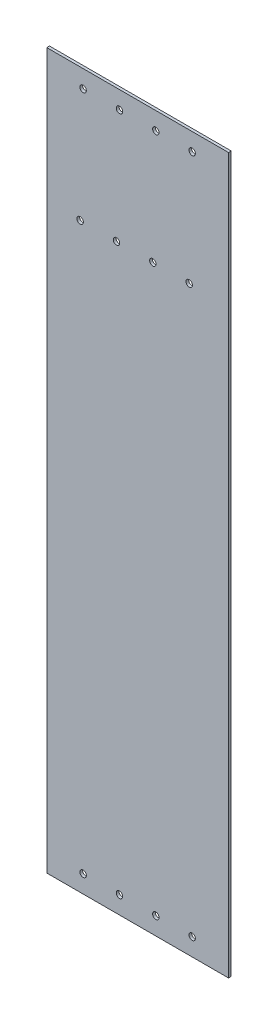
ISO-10303-21;
HEADER;
FILE_DESCRIPTION(('STEP AP214'),'2;1');
FILE_NAME('part.step','',(''),(''),'','','');
FILE_SCHEMA(('AUTOMOTIVE_DESIGN { 1 0 10303 214 1 1 1 1 }'));
ENDSEC;
DATA;
#1=APPLICATION_CONTEXT('core data for automotive mechanical design processes');
#2=APPLICATION_PROTOCOL_DEFINITION('international standard','automotive_design',2000,#1);
#3=PRODUCT_CONTEXT('',#1,'mechanical');
#4=PRODUCT('Part','Part','',(#3));
#5=PRODUCT_RELATED_PRODUCT_CATEGORY('part','',(#4));
#6=PRODUCT_DEFINITION_FORMATION('','',#4);
#7=PRODUCT_DEFINITION_CONTEXT('part definition',#1,'design');
#8=PRODUCT_DEFINITION('design','',#6,#7);
#9=PRODUCT_DEFINITION_SHAPE('','',#8);
#10=(LENGTH_UNIT() NAMED_UNIT(*) SI_UNIT(.MILLI.,.METRE.));
#11=(NAMED_UNIT(*) PLANE_ANGLE_UNIT() SI_UNIT($,.RADIAN.));
#12=(NAMED_UNIT(*) SI_UNIT($,.STERADIAN.) SOLID_ANGLE_UNIT());
#13=UNCERTAINTY_MEASURE_WITH_UNIT(LENGTH_MEASURE(1.E-05),#10,'distance_accuracy_value','');
#14=(GEOMETRIC_REPRESENTATION_CONTEXT(3) GLOBAL_UNCERTAINTY_ASSIGNED_CONTEXT((#13)) GLOBAL_UNIT_ASSIGNED_CONTEXT((#10,
#11,#12)) REPRESENTATION_CONTEXT('',''));
#15=CARTESIAN_POINT('',(0.,0.,0.));
#16=DIRECTION('',(0.,0.,1.));
#17=DIRECTION('',(1.,0.,0.));
#18=AXIS2_PLACEMENT_3D('',#15,#16,#17);
#19=CARTESIAN_POINT('',(43.96,191.395,0.));
#20=DIRECTION('',(0.,0.,1.));
#21=DIRECTION('',(1.,0.,0.));
#22=AXIS2_PLACEMENT_3D('',#19,#20,#21);
#23=CYLINDRICAL_SURFACE('',#22,2.75);
#24=CARTESIAN_POINT('',(43.96,191.395,0.));
#25=DIRECTION('',(0.,0.,1.));
#26=DIRECTION('',(1.,0.,0.));
#27=AXIS2_PLACEMENT_3D('',#24,#25,#26);
#28=CIRCLE('',#27,2.75);
#29=CARTESIAN_POINT('',(46.71,191.395,0.));
#30=VERTEX_POINT('',#29);
#31=EDGE_CURVE('E48',#30,#30,#28,.T.);
#32=ORIENTED_EDGE('',*,*,#31,.F.);
#33=EDGE_LOOP('',(#32));
#34=FACE_BOUND('',#33,.T.);
#35=CARTESIAN_POINT('',(43.96,191.395,2.305));
#36=DIRECTION('',(0.,0.,1.));
#37=DIRECTION('',(1.,0.,0.));
#38=AXIS2_PLACEMENT_3D('',#35,#36,#37);
#39=CIRCLE('',#38,2.75);
#40=CARTESIAN_POINT('',(46.71,191.395,2.305));
#41=VERTEX_POINT('',#40);
#42=EDGE_CURVE('E11',#41,#41,#39,.T.);
#43=ORIENTED_EDGE('',*,*,#42,.T.);
#44=EDGE_LOOP('',(#43));
#45=FACE_BOUND('',#44,.T.);
#46=ADVANCED_FACE('F39',(#34,#45),#23,.F.);
#47=CARTESIAN_POINT('',(12.96,191.395,0.));
#48=DIRECTION('',(0.,0.,1.));
#49=DIRECTION('',(1.,0.,0.));
#50=AXIS2_PLACEMENT_3D('',#47,#48,#49);
#51=CYLINDRICAL_SURFACE('',#50,2.75);
#52=CARTESIAN_POINT('',(12.96,191.395,0.));
#53=DIRECTION('',(0.,0.,1.));
#54=DIRECTION('',(1.,0.,0.));
#55=AXIS2_PLACEMENT_3D('',#52,#53,#54);
#56=CIRCLE('',#55,2.75);
#57=CARTESIAN_POINT('',(15.71,191.395,0.));
#58=VERTEX_POINT('',#57);
#59=EDGE_CURVE('E129',#58,#58,#56,.T.);
#60=ORIENTED_EDGE('',*,*,#59,.F.);
#61=EDGE_LOOP('',(#60));
#62=FACE_BOUND('',#61,.T.);
#63=CARTESIAN_POINT('',(12.96,191.395,2.305));
#64=DIRECTION('',(0.,0.,1.));
#65=DIRECTION('',(1.,0.,0.));
#66=AXIS2_PLACEMENT_3D('',#63,#64,#65);
#67=CIRCLE('',#66,2.75);
#68=CARTESIAN_POINT('',(15.71,191.395,2.305));
#69=VERTEX_POINT('',#68);
#70=EDGE_CURVE('E133',#69,#69,#67,.T.);
#71=ORIENTED_EDGE('',*,*,#70,.T.);
#72=EDGE_LOOP('',(#71));
#73=FACE_BOUND('',#72,.T.);
#74=ADVANCED_FACE('F144',(#62,#73),#51,.F.);
#75=CARTESIAN_POINT('',(77.5,304.8,2.305));
#76=DIRECTION('',(-1.,0.,0.));
#77=DIRECTION('',(0.,-1.,0.));
#78=AXIS2_PLACEMENT_3D('',#75,#76,#77);
#79=PLANE('',#78);
#80=DIRECTION('',(0.,1.,0.));
#81=VECTOR('',#80,1.);
#82=CARTESIAN_POINT('',(77.5,304.8,0.));
#83=LINE('',#82,#81);
#84=CARTESIAN_POINT('',(77.5000000000001,-304.8,0.));
#85=VERTEX_POINT('',#84);
#86=CARTESIAN_POINT('',(77.5,304.8,0.));
#87=VERTEX_POINT('',#86);
#88=EDGE_CURVE('E112',#85,#87,#83,.T.);
#89=ORIENTED_EDGE('',*,*,#88,.T.);
#90=DIRECTION('',(0.,0.,-1.));
#91=VECTOR('',#90,1.);
#92=CARTESIAN_POINT('',(77.5,304.8,2.305));
#93=LINE('',#92,#91);
#94=CARTESIAN_POINT('',(77.5,304.8,2.305));
#95=VERTEX_POINT('',#94);
#96=EDGE_CURVE('E101',#95,#87,#93,.T.);
#97=ORIENTED_EDGE('',*,*,#96,.F.);
#98=DIRECTION('',(0.,1.,0.));
#99=VECTOR('',#98,1.);
#100=CARTESIAN_POINT('',(77.5,304.8,2.305));
#101=LINE('',#100,#99);
#102=CARTESIAN_POINT('',(77.5000000000001,-304.8,2.305));
#103=VERTEX_POINT('',#102);
#104=EDGE_CURVE('E93',#103,#95,#101,.T.);
#105=ORIENTED_EDGE('',*,*,#104,.F.);
#106=DIRECTION('',(0.,0.,-1.));
#107=VECTOR('',#106,1.);
#108=CARTESIAN_POINT('',(77.5000000000001,-304.8,2.305));
#109=LINE('',#108,#107);
#110=EDGE_CURVE('E108',#103,#85,#109,.T.);
#111=ORIENTED_EDGE('',*,*,#110,.T.);
#112=EDGE_LOOP('',(#89,#97,#105,#111));
#113=FACE_BOUND('',#112,.T.);
#114=ADVANCED_FACE('F168',(#113),#79,.F.);
#115=CARTESIAN_POINT('',(-77.5,304.8,2.305));
#116=DIRECTION('',(0.,-1.,0.));
#117=DIRECTION('',(0.,0.,-1.));
#118=AXIS2_PLACEMENT_3D('',#115,#116,#117);
#119=PLANE('',#118);
#120=DIRECTION('',(-1.,0.,0.));
#121=VECTOR('',#120,1.);
#122=CARTESIAN_POINT('',(-77.5,304.8,0.));
#123=LINE('',#122,#121);
#124=CARTESIAN_POINT('',(-77.5,304.8,0.));
#125=VERTEX_POINT('',#124);
#126=EDGE_CURVE('E99',#87,#125,#123,.T.);
#127=ORIENTED_EDGE('',*,*,#126,.T.);
#128=DIRECTION('',(0.,0.,-1.));
#129=VECTOR('',#128,1.);
#130=CARTESIAN_POINT('',(-77.5,304.8,2.305));
#131=LINE('',#130,#129);
#132=CARTESIAN_POINT('',(-77.5,304.8,2.305));
#133=VERTEX_POINT('',#132);
#134=EDGE_CURVE('E97',#133,#125,#131,.T.);
#135=ORIENTED_EDGE('',*,*,#134,.F.);
#136=DIRECTION('',(-1.,0.,0.));
#137=VECTOR('',#136,1.);
#138=CARTESIAN_POINT('',(-77.5,304.8,2.305));
#139=LINE('',#138,#137);
#140=EDGE_CURVE('E87',#95,#133,#139,.T.);
#141=ORIENTED_EDGE('',*,*,#140,.F.);
#142=ORIENTED_EDGE('',*,*,#96,.T.);
#143=EDGE_LOOP('',(#127,#135,#141,#142));
#144=FACE_BOUND('',#143,.T.);
#145=ADVANCED_FACE('F98',(#144),#119,.F.);
#146=CARTESIAN_POINT('',(-77.5,304.8,2.305));
#147=DIRECTION('',(1.,0.,0.));
#148=DIRECTION('',(0.,1.,0.));
#149=AXIS2_PLACEMENT_3D('',#146,#147,#148);
#150=PLANE('',#149);
#151=DIRECTION('',(0.,-1.,0.));
#152=VECTOR('',#151,1.);
#153=CARTESIAN_POINT('',(-77.5,304.8,0.));
#154=LINE('',#153,#152);
#155=CARTESIAN_POINT('',(-77.4999999999999,-304.8,0.));
#156=VERTEX_POINT('',#155);
#157=EDGE_CURVE('E73',#125,#156,#154,.T.);
#158=ORIENTED_EDGE('',*,*,#157,.T.);
#159=DIRECTION('',(0.,0.,-1.));
#160=VECTOR('',#159,1.);
#161=CARTESIAN_POINT('',(-77.4999999999999,-304.8,2.305));
#162=LINE('',#161,#160);
#163=CARTESIAN_POINT('',(-77.4999999999999,-304.8,2.305));
#164=VERTEX_POINT('',#163);
#165=EDGE_CURVE('E102',#164,#156,#162,.T.);
#166=ORIENTED_EDGE('',*,*,#165,.F.);
#167=DIRECTION('',(0.,-1.,0.));
#168=VECTOR('',#167,1.);
#169=CARTESIAN_POINT('',(-77.5,304.8,2.305));
#170=LINE('',#169,#168);
#171=EDGE_CURVE('E91',#133,#164,#170,.T.);
#172=ORIENTED_EDGE('',*,*,#171,.F.);
#173=ORIENTED_EDGE('',*,*,#134,.T.);
#174=EDGE_LOOP('',(#158,#166,#172,#173));
#175=FACE_BOUND('',#174,.T.);
#176=ADVANCED_FACE('F104',(#175),#150,.F.);
#177=CARTESIAN_POINT('',(-77.4999999999999,-304.8,2.305));
#178=DIRECTION('',(0.,1.,0.));
#179=DIRECTION('',(0.,0.,1.));
#180=AXIS2_PLACEMENT_3D('',#177,#178,#179);
#181=PLANE('',#180);
#182=DIRECTION('',(1.,0.,0.));
#183=VECTOR('',#182,1.);
#184=CARTESIAN_POINT('',(-77.4999999999999,-304.8,0.));
#185=LINE('',#184,#183);
#186=EDGE_CURVE('E79',#156,#85,#185,.T.);
#187=ORIENTED_EDGE('',*,*,#186,.T.);
#188=ORIENTED_EDGE('',*,*,#110,.F.);
#189=DIRECTION('',(1.,0.,0.));
#190=VECTOR('',#189,1.);
#191=CARTESIAN_POINT('',(-77.4999999999999,-304.8,2.305));
#192=LINE('',#191,#190);
#193=EDGE_CURVE('E56',#164,#103,#192,.T.);
#194=ORIENTED_EDGE('',*,*,#193,.F.);
#195=ORIENTED_EDGE('',*,*,#165,.T.);
#196=EDGE_LOOP('',(#187,#188,#194,#195));
#197=FACE_BOUND('',#196,.T.);
#198=ADVANCED_FACE('F148',(#197),#181,.F.);
#199=CARTESIAN_POINT('',(0.,0.,2.305));
#200=DIRECTION('',(0.,0.,1.));
#201=DIRECTION('',(1.,0.,0.));
#202=AXIS2_PLACEMENT_3D('',#199,#200,#201);
#203=PLANE('',#202);
#204=CARTESIAN_POINT('',(-18.04,191.395,2.305));
#205=DIRECTION('',(0.,0.,1.));
#206=DIRECTION('',(1.,0.,0.));
#207=AXIS2_PLACEMENT_3D('',#204,#205,#206);
#208=CIRCLE('',#207,2.75);
#209=CARTESIAN_POINT('',(-15.29,191.395,2.305));
#210=VERTEX_POINT('',#209);
#211=EDGE_CURVE('E319',#210,#210,#208,.T.);
#212=ORIENTED_EDGE('',*,*,#211,.F.);
#213=EDGE_LOOP('',(#212));
#214=FACE_BOUND('',#213,.T.);
#215=CARTESIAN_POINT('',(-49.04,191.395,2.305));
#216=DIRECTION('',(0.,0.,1.));
#217=DIRECTION('',(1.,0.,0.));
#218=AXIS2_PLACEMENT_3D('',#215,#216,#217);
#219=CIRCLE('',#218,2.75);
#220=CARTESIAN_POINT('',(-46.29,191.395,2.305));
#221=VERTEX_POINT('',#220);
#222=EDGE_CURVE('E321',#221,#221,#219,.T.);
#223=ORIENTED_EDGE('',*,*,#222,.F.);
#224=EDGE_LOOP('',(#223));
#225=FACE_BOUND('',#224,.T.);
#226=CARTESIAN_POINT('',(-46.5,289.795,2.305));
#227=DIRECTION('',(0.,0.,1.));
#228=DIRECTION('',(1.,0.,0.));
#229=AXIS2_PLACEMENT_3D('',#226,#227,#228);
#230=CIRCLE('',#229,2.74999999999999);
#231=CARTESIAN_POINT('',(-43.75,289.795,2.305));
#232=VERTEX_POINT('',#231);
#233=EDGE_CURVE('E332',#232,#232,#230,.T.);
#234=ORIENTED_EDGE('',*,*,#233,.F.);
#235=EDGE_LOOP('',(#234));
#236=FACE_BOUND('',#235,.T.);
#237=CARTESIAN_POINT('',(-15.5,289.795,2.305));
#238=DIRECTION('',(0.,0.,1.));
#239=DIRECTION('',(1.,0.,0.));
#240=AXIS2_PLACEMENT_3D('',#237,#238,#239);
#241=CIRCLE('',#240,2.74999999999999);
#242=CARTESIAN_POINT('',(-12.75,289.795,2.305));
#243=VERTEX_POINT('',#242);
#244=EDGE_CURVE('E341',#243,#243,#241,.T.);
#245=ORIENTED_EDGE('',*,*,#244,.F.);
#246=EDGE_LOOP('',(#245));
#247=FACE_BOUND('',#246,.T.);
#248=CARTESIAN_POINT('',(15.5,289.795,2.305));
#249=DIRECTION('',(0.,0.,1.));
#250=DIRECTION('',(1.,0.,0.));
#251=AXIS2_PLACEMENT_3D('',#248,#249,#250);
#252=CIRCLE('',#251,2.74999999999999);
#253=CARTESIAN_POINT('',(18.25,289.795,2.305));
#254=VERTEX_POINT('',#253);
#255=EDGE_CURVE('E349',#254,#254,#252,.T.);
#256=ORIENTED_EDGE('',*,*,#255,.F.);
#257=EDGE_LOOP('',(#256));
#258=FACE_BOUND('',#257,.T.);
#259=CARTESIAN_POINT('',(46.5,289.795,2.305));
#260=DIRECTION('',(0.,0.,1.));
#261=DIRECTION('',(1.,0.,0.));
#262=AXIS2_PLACEMENT_3D('',#259,#260,#261);
#263=CIRCLE('',#262,2.74999999999999);
#264=CARTESIAN_POINT('',(49.25,289.795,2.305));
#265=VERTEX_POINT('',#264);
#266=EDGE_CURVE('E357',#265,#265,#263,.T.);
#267=ORIENTED_EDGE('',*,*,#266,.F.);
#268=EDGE_LOOP('',(#267));
#269=FACE_BOUND('',#268,.T.);
#270=CARTESIAN_POINT('',(-46.5,-289.795,2.305));
#271=DIRECTION('',(0.,0.,1.));
#272=DIRECTION('',(1.,0.,0.));
#273=AXIS2_PLACEMENT_3D('',#270,#271,#272);
#274=CIRCLE('',#273,2.74999999999999);
#275=CARTESIAN_POINT('',(-43.75,-289.795,2.305));
#276=VERTEX_POINT('',#275);
#277=EDGE_CURVE('E365',#276,#276,#274,.T.);
#278=ORIENTED_EDGE('',*,*,#277,.F.);
#279=EDGE_LOOP('',(#278));
#280=FACE_BOUND('',#279,.T.);
#281=CARTESIAN_POINT('',(-15.5,-289.795,2.305));
#282=DIRECTION('',(0.,0.,1.));
#283=DIRECTION('',(1.,0.,0.));
#284=AXIS2_PLACEMENT_3D('',#281,#282,#283);
#285=CIRCLE('',#284,2.74999999999999);
#286=CARTESIAN_POINT('',(-12.75,-289.795,2.305));
#287=VERTEX_POINT('',#286);
#288=EDGE_CURVE('E373',#287,#287,#285,.T.);
#289=ORIENTED_EDGE('',*,*,#288,.F.);
#290=EDGE_LOOP('',(#289));
#291=FACE_BOUND('',#290,.T.);
#292=CARTESIAN_POINT('',(15.5,-289.795,2.305));
#293=DIRECTION('',(0.,0.,1.));
#294=DIRECTION('',(1.,0.,0.));
#295=AXIS2_PLACEMENT_3D('',#292,#293,#294);
#296=CIRCLE('',#295,2.74999999999999);
#297=CARTESIAN_POINT('',(18.25,-289.795,2.305));
#298=VERTEX_POINT('',#297);
#299=EDGE_CURVE('E381',#298,#298,#296,.T.);
#300=ORIENTED_EDGE('',*,*,#299,.F.);
#301=EDGE_LOOP('',(#300));
#302=FACE_BOUND('',#301,.T.);
#303=CARTESIAN_POINT('',(46.5,-289.795,2.305));
#304=DIRECTION('',(0.,0.,1.));
#305=DIRECTION('',(1.,0.,0.));
#306=AXIS2_PLACEMENT_3D('',#303,#304,#305);
#307=CIRCLE('',#306,2.74999999999999);
#308=CARTESIAN_POINT('',(49.25,-289.795,2.305));
#309=VERTEX_POINT('',#308);
#310=EDGE_CURVE('E389',#309,#309,#307,.T.);
#311=ORIENTED_EDGE('',*,*,#310,.F.);
#312=EDGE_LOOP('',(#311));
#313=FACE_BOUND('',#312,.T.);
#314=ORIENTED_EDGE('',*,*,#104,.T.);
#315=ORIENTED_EDGE('',*,*,#140,.T.);
#316=ORIENTED_EDGE('',*,*,#171,.T.);
#317=ORIENTED_EDGE('',*,*,#193,.T.);
#318=EDGE_LOOP('',(#314,#315,#316,#317));
#319=FACE_BOUND('',#318,.T.);
#320=ORIENTED_EDGE('',*,*,#70,.F.);
#321=EDGE_LOOP('',(#320));
#322=FACE_BOUND('',#321,.T.);
#323=ORIENTED_EDGE('',*,*,#42,.F.);
#324=EDGE_LOOP('',(#323));
#325=FACE_BOUND('',#324,.T.);
#326=ADVANCED_FACE('F88',(#214,#225,#236,#247,#258,#269,#280,#291,#302,#313,#319,#322,#325),
#203,.T.);
#327=CARTESIAN_POINT('',(0.,0.,0.));
#328=DIRECTION('',(0.,0.,1.));
#329=DIRECTION('',(1.,0.,0.));
#330=AXIS2_PLACEMENT_3D('',#327,#328,#329);
#331=PLANE('',#330);
#332=CARTESIAN_POINT('',(-18.04,191.395,0.));
#333=DIRECTION('',(0.,0.,1.));
#334=DIRECTION('',(1.,0.,0.));
#335=AXIS2_PLACEMENT_3D('',#332,#333,#334);
#336=CIRCLE('',#335,2.75);
#337=CARTESIAN_POINT('',(-15.29,191.395,0.));
#338=VERTEX_POINT('',#337);
#339=EDGE_CURVE('E317',#338,#338,#336,.T.);
#340=ORIENTED_EDGE('',*,*,#339,.T.);
#341=EDGE_LOOP('',(#340));
#342=FACE_BOUND('',#341,.T.);
#343=CARTESIAN_POINT('',(-49.04,191.395,0.));
#344=DIRECTION('',(0.,0.,1.));
#345=DIRECTION('',(1.,0.,0.));
#346=AXIS2_PLACEMENT_3D('',#343,#344,#345);
#347=CIRCLE('',#346,2.75);
#348=CARTESIAN_POINT('',(-46.29,191.395,0.));
#349=VERTEX_POINT('',#348);
#350=EDGE_CURVE('E326',#349,#349,#347,.T.);
#351=ORIENTED_EDGE('',*,*,#350,.T.);
#352=EDGE_LOOP('',(#351));
#353=FACE_BOUND('',#352,.T.);
#354=CARTESIAN_POINT('',(-46.5,289.795,0.));
#355=DIRECTION('',(0.,0.,1.));
#356=DIRECTION('',(1.,0.,0.));
#357=AXIS2_PLACEMENT_3D('',#354,#355,#356);
#358=CIRCLE('',#357,2.75);
#359=CARTESIAN_POINT('',(-43.75,289.795,0.));
#360=VERTEX_POINT('',#359);
#361=EDGE_CURVE('E337',#360,#360,#358,.T.);
#362=ORIENTED_EDGE('',*,*,#361,.T.);
#363=EDGE_LOOP('',(#362));
#364=FACE_BOUND('',#363,.T.);
#365=CARTESIAN_POINT('',(-15.5,289.795,0.));
#366=DIRECTION('',(0.,0.,1.));
#367=DIRECTION('',(1.,0.,0.));
#368=AXIS2_PLACEMENT_3D('',#365,#366,#367);
#369=CIRCLE('',#368,2.75);
#370=CARTESIAN_POINT('',(-12.75,289.795,0.));
#371=VERTEX_POINT('',#370);
#372=EDGE_CURVE('E345',#371,#371,#369,.T.);
#373=ORIENTED_EDGE('',*,*,#372,.T.);
#374=EDGE_LOOP('',(#373));
#375=FACE_BOUND('',#374,.T.);
#376=CARTESIAN_POINT('',(15.5,289.795,0.));
#377=DIRECTION('',(0.,0.,1.));
#378=DIRECTION('',(1.,0.,0.));
#379=AXIS2_PLACEMENT_3D('',#376,#377,#378);
#380=CIRCLE('',#379,2.75);
#381=CARTESIAN_POINT('',(18.25,289.795,0.));
#382=VERTEX_POINT('',#381);
#383=EDGE_CURVE('E353',#382,#382,#380,.T.);
#384=ORIENTED_EDGE('',*,*,#383,.T.);
#385=EDGE_LOOP('',(#384));
#386=FACE_BOUND('',#385,.T.);
#387=CARTESIAN_POINT('',(46.5,289.795,0.));
#388=DIRECTION('',(0.,0.,1.));
#389=DIRECTION('',(1.,0.,0.));
#390=AXIS2_PLACEMENT_3D('',#387,#388,#389);
#391=CIRCLE('',#390,2.75);
#392=CARTESIAN_POINT('',(49.25,289.795,0.));
#393=VERTEX_POINT('',#392);
#394=EDGE_CURVE('E361',#393,#393,#391,.T.);
#395=ORIENTED_EDGE('',*,*,#394,.T.);
#396=EDGE_LOOP('',(#395));
#397=FACE_BOUND('',#396,.T.);
#398=CARTESIAN_POINT('',(-46.5,-289.795,0.));
#399=DIRECTION('',(0.,0.,1.));
#400=DIRECTION('',(1.,0.,0.));
#401=AXIS2_PLACEMENT_3D('',#398,#399,#400);
#402=CIRCLE('',#401,2.75);
#403=CARTESIAN_POINT('',(-43.75,-289.795,0.));
#404=VERTEX_POINT('',#403);
#405=EDGE_CURVE('E369',#404,#404,#402,.T.);
#406=ORIENTED_EDGE('',*,*,#405,.T.);
#407=EDGE_LOOP('',(#406));
#408=FACE_BOUND('',#407,.T.);
#409=CARTESIAN_POINT('',(-15.5,-289.795,0.));
#410=DIRECTION('',(0.,0.,1.));
#411=DIRECTION('',(1.,0.,0.));
#412=AXIS2_PLACEMENT_3D('',#409,#410,#411);
#413=CIRCLE('',#412,2.75);
#414=CARTESIAN_POINT('',(-12.75,-289.795,0.));
#415=VERTEX_POINT('',#414);
#416=EDGE_CURVE('E377',#415,#415,#413,.T.);
#417=ORIENTED_EDGE('',*,*,#416,.T.);
#418=EDGE_LOOP('',(#417));
#419=FACE_BOUND('',#418,.T.);
#420=CARTESIAN_POINT('',(15.5,-289.795,0.));
#421=DIRECTION('',(0.,0.,1.));
#422=DIRECTION('',(1.,0.,0.));
#423=AXIS2_PLACEMENT_3D('',#420,#421,#422);
#424=CIRCLE('',#423,2.75);
#425=CARTESIAN_POINT('',(18.25,-289.795,0.));
#426=VERTEX_POINT('',#425);
#427=EDGE_CURVE('E385',#426,#426,#424,.T.);
#428=ORIENTED_EDGE('',*,*,#427,.T.);
#429=EDGE_LOOP('',(#428));
#430=FACE_BOUND('',#429,.T.);
#431=CARTESIAN_POINT('',(46.5,-289.795,0.));
#432=DIRECTION('',(0.,0.,1.));
#433=DIRECTION('',(1.,0.,0.));
#434=AXIS2_PLACEMENT_3D('',#431,#432,#433);
#435=CIRCLE('',#434,2.75);
#436=CARTESIAN_POINT('',(49.25,-289.795,0.));
#437=VERTEX_POINT('',#436);
#438=EDGE_CURVE('E116',#437,#437,#435,.T.);
#439=ORIENTED_EDGE('',*,*,#438,.T.);
#440=EDGE_LOOP('',(#439));
#441=FACE_BOUND('',#440,.T.);
#442=ORIENTED_EDGE('',*,*,#88,.F.);
#443=ORIENTED_EDGE('',*,*,#186,.F.);
#444=ORIENTED_EDGE('',*,*,#157,.F.);
#445=ORIENTED_EDGE('',*,*,#126,.F.);
#446=EDGE_LOOP('',(#442,#443,#444,#445));
#447=FACE_BOUND('',#446,.T.);
#448=ORIENTED_EDGE('',*,*,#59,.T.);
#449=EDGE_LOOP('',(#448));
#450=FACE_BOUND('',#449,.T.);
#451=ORIENTED_EDGE('',*,*,#31,.T.);
#452=EDGE_LOOP('',(#451));
#453=FACE_BOUND('',#452,.T.);
#454=ADVANCED_FACE('F140',(#342,#353,#364,#375,#386,#397,#408,#419,#430,#441,#447,#450,#453),
#331,.F.);
#455=CARTESIAN_POINT('',(46.5,-289.795,2.305));
#456=DIRECTION('',(0.,0.,1.));
#457=DIRECTION('',(1.,0.,0.));
#458=AXIS2_PLACEMENT_3D('',#455,#456,#457);
#459=CYLINDRICAL_SURFACE('',#458,2.74999999999999);
#460=ORIENTED_EDGE('',*,*,#438,.F.);
#461=EDGE_LOOP('',(#460));
#462=FACE_BOUND('',#461,.T.);
#463=ORIENTED_EDGE('',*,*,#310,.T.);
#464=EDGE_LOOP('',(#463));
#465=FACE_BOUND('',#464,.T.);
#466=ADVANCED_FACE('F155',(#462,#465),#459,.F.);
#467=CARTESIAN_POINT('',(15.5,-289.795,2.305));
#468=DIRECTION('',(0.,0.,1.));
#469=DIRECTION('',(1.,0.,0.));
#470=AXIS2_PLACEMENT_3D('',#467,#468,#469);
#471=CYLINDRICAL_SURFACE('',#470,2.74999999999999);
#472=ORIENTED_EDGE('',*,*,#427,.F.);
#473=EDGE_LOOP('',(#472));
#474=FACE_BOUND('',#473,.T.);
#475=ORIENTED_EDGE('',*,*,#299,.T.);
#476=EDGE_LOOP('',(#475));
#477=FACE_BOUND('',#476,.T.);
#478=ADVANCED_FACE('F207',(#474,#477),#471,.F.);
#479=CARTESIAN_POINT('',(-15.5,-289.795,2.305));
#480=DIRECTION('',(0.,0.,1.));
#481=DIRECTION('',(1.,0.,0.));
#482=AXIS2_PLACEMENT_3D('',#479,#480,#481);
#483=CYLINDRICAL_SURFACE('',#482,2.74999999999999);
#484=ORIENTED_EDGE('',*,*,#416,.F.);
#485=EDGE_LOOP('',(#484));
#486=FACE_BOUND('',#485,.T.);
#487=ORIENTED_EDGE('',*,*,#288,.T.);
#488=EDGE_LOOP('',(#487));
#489=FACE_BOUND('',#488,.T.);
#490=ADVANCED_FACE('F217',(#486,#489),#483,.F.);
#491=CARTESIAN_POINT('',(-46.5,-289.795,2.305));
#492=DIRECTION('',(0.,0.,1.));
#493=DIRECTION('',(1.,0.,0.));
#494=AXIS2_PLACEMENT_3D('',#491,#492,#493);
#495=CYLINDRICAL_SURFACE('',#494,2.74999999999999);
#496=ORIENTED_EDGE('',*,*,#405,.F.);
#497=EDGE_LOOP('',(#496));
#498=FACE_BOUND('',#497,.T.);
#499=ORIENTED_EDGE('',*,*,#277,.T.);
#500=EDGE_LOOP('',(#499));
#501=FACE_BOUND('',#500,.T.);
#502=ADVANCED_FACE('F226',(#498,#501),#495,.F.);
#503=CARTESIAN_POINT('',(46.5,289.795,2.305));
#504=DIRECTION('',(0.,0.,1.));
#505=DIRECTION('',(1.,0.,0.));
#506=AXIS2_PLACEMENT_3D('',#503,#504,#505);
#507=CYLINDRICAL_SURFACE('',#506,2.74999999999999);
#508=ORIENTED_EDGE('',*,*,#394,.F.);
#509=EDGE_LOOP('',(#508));
#510=FACE_BOUND('',#509,.T.);
#511=ORIENTED_EDGE('',*,*,#266,.T.);
#512=EDGE_LOOP('',(#511));
#513=FACE_BOUND('',#512,.T.);
#514=ADVANCED_FACE('F236',(#510,#513),#507,.F.);
#515=CARTESIAN_POINT('',(15.5,289.795,2.305));
#516=DIRECTION('',(0.,0.,1.));
#517=DIRECTION('',(1.,0.,0.));
#518=AXIS2_PLACEMENT_3D('',#515,#516,#517);
#519=CYLINDRICAL_SURFACE('',#518,2.74999999999999);
#520=ORIENTED_EDGE('',*,*,#383,.F.);
#521=EDGE_LOOP('',(#520));
#522=FACE_BOUND('',#521,.T.);
#523=ORIENTED_EDGE('',*,*,#255,.T.);
#524=EDGE_LOOP('',(#523));
#525=FACE_BOUND('',#524,.T.);
#526=ADVANCED_FACE('F246',(#522,#525),#519,.F.);
#527=CARTESIAN_POINT('',(-15.5,289.795,2.305));
#528=DIRECTION('',(0.,0.,1.));
#529=DIRECTION('',(1.,0.,0.));
#530=AXIS2_PLACEMENT_3D('',#527,#528,#529);
#531=CYLINDRICAL_SURFACE('',#530,2.74999999999999);
#532=ORIENTED_EDGE('',*,*,#372,.F.);
#533=EDGE_LOOP('',(#532));
#534=FACE_BOUND('',#533,.T.);
#535=ORIENTED_EDGE('',*,*,#244,.T.);
#536=EDGE_LOOP('',(#535));
#537=FACE_BOUND('',#536,.T.);
#538=ADVANCED_FACE('F256',(#534,#537),#531,.F.);
#539=CARTESIAN_POINT('',(-46.5,289.795,2.305));
#540=DIRECTION('',(0.,0.,1.));
#541=DIRECTION('',(1.,0.,0.));
#542=AXIS2_PLACEMENT_3D('',#539,#540,#541);
#543=CYLINDRICAL_SURFACE('',#542,2.74999999999999);
#544=ORIENTED_EDGE('',*,*,#361,.F.);
#545=EDGE_LOOP('',(#544));
#546=FACE_BOUND('',#545,.T.);
#547=ORIENTED_EDGE('',*,*,#233,.T.);
#548=EDGE_LOOP('',(#547));
#549=FACE_BOUND('',#548,.T.);
#550=ADVANCED_FACE('F266',(#546,#549),#543,.F.);
#551=CARTESIAN_POINT('',(-49.04,191.395,0.));
#552=DIRECTION('',(0.,0.,1.));
#553=DIRECTION('',(1.,0.,0.));
#554=AXIS2_PLACEMENT_3D('',#551,#552,#553);
#555=CYLINDRICAL_SURFACE('',#554,2.75);
#556=ORIENTED_EDGE('',*,*,#350,.F.);
#557=EDGE_LOOP('',(#556));
#558=FACE_BOUND('',#557,.T.);
#559=ORIENTED_EDGE('',*,*,#222,.T.);
#560=EDGE_LOOP('',(#559));
#561=FACE_BOUND('',#560,.T.);
#562=ADVANCED_FACE('F276',(#558,#561),#555,.F.);
#563=CARTESIAN_POINT('',(-18.04,191.395,0.));
#564=DIRECTION('',(0.,0.,1.));
#565=DIRECTION('',(1.,0.,0.));
#566=AXIS2_PLACEMENT_3D('',#563,#564,#565);
#567=CYLINDRICAL_SURFACE('',#566,2.75);
#568=ORIENTED_EDGE('',*,*,#339,.F.);
#569=EDGE_LOOP('',(#568));
#570=FACE_BOUND('',#569,.T.);
#571=ORIENTED_EDGE('',*,*,#211,.T.);
#572=EDGE_LOOP('',(#571));
#573=FACE_BOUND('',#572,.T.);
#574=ADVANCED_FACE('F285',(#570,#573),#567,.F.);
#575=CLOSED_SHELL('',(#46,#74,#114,#145,#176,#198,#326,#454,#466,#478,#490,#502,#514,#526,#538,
#550,#562,#574));
#576=MANIFOLD_SOLID_BREP('B2',#575);
#577=ADVANCED_BREP_SHAPE_REPRESENTATION('',(#18,#576),#14);
#578=SHAPE_DEFINITION_REPRESENTATION(#9,#577);
ENDSEC;
END-ISO-10303-21;
